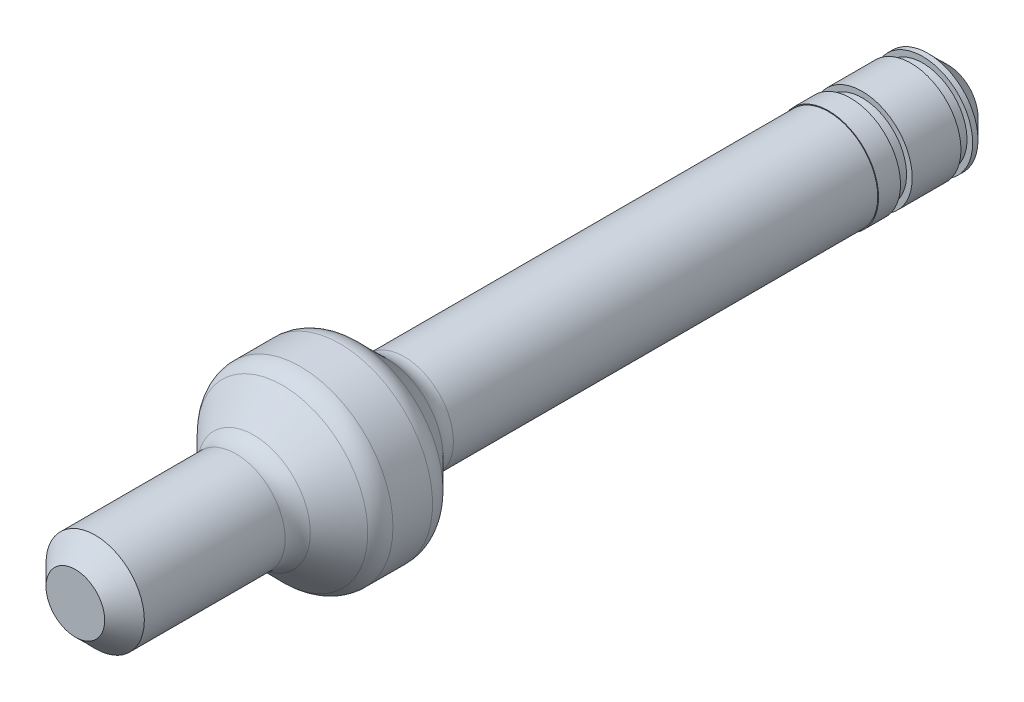
ISO-10303-21;
HEADER;
FILE_DESCRIPTION(('STEP AP214'),'2;1');
FILE_NAME('part.step','',(''),(''),'','','');
FILE_SCHEMA(('AUTOMOTIVE_DESIGN { 1 0 10303 214 1 1 1 1 }'));
ENDSEC;
DATA;
#1=APPLICATION_CONTEXT('core data for automotive mechanical design processes');
#2=APPLICATION_PROTOCOL_DEFINITION('international standard','automotive_design',2000,#1);
#3=PRODUCT_CONTEXT('',#1,'mechanical');
#4=PRODUCT('Part','Part','',(#3));
#5=PRODUCT_RELATED_PRODUCT_CATEGORY('part','',(#4));
#6=PRODUCT_DEFINITION_FORMATION('','',#4);
#7=PRODUCT_DEFINITION_CONTEXT('part definition',#1,'design');
#8=PRODUCT_DEFINITION('design','',#6,#7);
#9=PRODUCT_DEFINITION_SHAPE('','',#8);
#10=(LENGTH_UNIT() NAMED_UNIT(*) SI_UNIT(.MILLI.,.METRE.));
#11=(NAMED_UNIT(*) PLANE_ANGLE_UNIT() SI_UNIT($,.RADIAN.));
#12=(NAMED_UNIT(*) SI_UNIT($,.STERADIAN.) SOLID_ANGLE_UNIT());
#13=UNCERTAINTY_MEASURE_WITH_UNIT(LENGTH_MEASURE(1.E-05),#10,'distance_accuracy_value','');
#14=(GEOMETRIC_REPRESENTATION_CONTEXT(3) GLOBAL_UNCERTAINTY_ASSIGNED_CONTEXT((#13)) GLOBAL_UNIT_ASSIGNED_CONTEXT((#10,
#11,#12)) REPRESENTATION_CONTEXT('',''));
#15=CARTESIAN_POINT('',(0.,0.,0.));
#16=DIRECTION('',(0.,0.,1.));
#17=DIRECTION('',(1.,0.,0.));
#18=AXIS2_PLACEMENT_3D('',#15,#16,#17);
#19=CARTESIAN_POINT('',(0.,3.1496,-39.572));
#20=DIRECTION('',(0.,0.,1.));
#21=DIRECTION('',(1.,0.,0.));
#22=AXIS2_PLACEMENT_3D('',#19,#20,#21);
#23=PLANE('',#22);
#24=CARTESIAN_POINT('',(0.,0.,-39.572000000021));
#25=DIRECTION('',(0.,0.,1.));
#26=DIRECTION('',(1.,0.,0.));
#27=AXIS2_PLACEMENT_3D('',#24,#25,#26);
#28=CIRCLE('',#27,1.89960000000156);
#29=CARTESIAN_POINT('',(1.89960000000156,0.,-39.572000000021));
#30=VERTEX_POINT('',#29);
#31=EDGE_CURVE('E19',#30,#30,#28,.T.);
#32=ORIENTED_EDGE('',*,*,#31,.F.);
#33=EDGE_LOOP('',(#32));
#34=FACE_BOUND('',#33,.T.);
#35=ADVANCED_FACE('F16',(#34),#23,.F.);
#36=CARTESIAN_POINT('',(0.,0.,-38.3219999999937));
#37=DIRECTION('',(0.,0.,1.));
#38=DIRECTION('',(1.,0.,0.));
#39=AXIS2_PLACEMENT_3D('',#36,#37,#38);
#40=CONICAL_SURFACE('',#39,3.149599999972,0.785398163374711);
#41=ORIENTED_EDGE('',*,*,#31,.T.);
#42=EDGE_LOOP('',(#41));
#43=FACE_BOUND('',#42,.T.);
#44=CARTESIAN_POINT('',(0.,0.,-38.322));
#45=DIRECTION('',(0.,0.,1.));
#46=DIRECTION('',(1.,0.,0.));
#47=AXIS2_PLACEMENT_3D('',#44,#45,#46);
#48=CIRCLE('',#47,3.1496);
#49=CARTESIAN_POINT('',(3.1496,0.,-38.322));
#50=VERTEX_POINT('',#49);
#51=EDGE_CURVE('E185',#50,#50,#48,.T.);
#52=ORIENTED_EDGE('',*,*,#51,.F.);
#53=EDGE_LOOP('',(#52));
#54=FACE_BOUND('',#53,.T.);
#55=ADVANCED_FACE('F120',(#43,#54),#40,.T.);
#56=CARTESIAN_POINT('',(0.,0.,26.453846));
#57=DIRECTION('',(0.,0.,1.));
#58=DIRECTION('',(1.,0.,0.));
#59=AXIS2_PLACEMENT_3D('',#56,#57,#58);
#60=CYLINDRICAL_SURFACE('',#59,3.1496);
#61=ORIENTED_EDGE('',*,*,#51,.T.);
#62=EDGE_LOOP('',(#61));
#63=FACE_BOUND('',#62,.T.);
#64=CARTESIAN_POINT('',(0.,0.,-37.9845));
#65=DIRECTION('',(0.,0.,1.));
#66=DIRECTION('',(1.,0.,0.));
#67=AXIS2_PLACEMENT_3D('',#64,#65,#66);
#68=CIRCLE('',#67,3.1496);
#69=CARTESIAN_POINT('',(3.1496,0.,-37.9845));
#70=VERTEX_POINT('',#69);
#71=EDGE_CURVE('E183',#70,#70,#68,.F.);
#72=ORIENTED_EDGE('',*,*,#71,.T.);
#73=EDGE_LOOP('',(#72));
#74=FACE_BOUND('',#73,.T.);
#75=ADVANCED_FACE('F117',(#63,#74),#60,.T.);
#76=CARTESIAN_POINT('',(0.,3.1,15.428));
#77=DIRECTION('',(0.,0.,-1.));
#78=DIRECTION('',(-1.,0.,0.));
#79=AXIS2_PLACEMENT_3D('',#76,#77,#78);
#80=PLANE('',#79);
#81=CARTESIAN_POINT('',(0.,0.,15.4279999999289));
#82=DIRECTION('',(0.,0.,-1.));
#83=DIRECTION('',(-1.,0.,0.));
#84=AXIS2_PLACEMENT_3D('',#81,#82,#83);
#85=CIRCLE('',#84,1.84999999999036);
#86=CARTESIAN_POINT('',(-1.84999999999036,0.,15.4279999999289));
#87=VERTEX_POINT('',#86);
#88=EDGE_CURVE('E181',#87,#87,#85,.T.);
#89=ORIENTED_EDGE('',*,*,#88,.F.);
#90=EDGE_LOOP('',(#89));
#91=FACE_BOUND('',#90,.T.);
#92=ADVANCED_FACE('F113',(#91),#80,.F.);
#93=CARTESIAN_POINT('',(0.,2.794,-37.9845));
#94=DIRECTION('',(0.,0.,-1.));
#95=DIRECTION('',(-1.,0.,0.));
#96=AXIS2_PLACEMENT_3D('',#93,#94,#95);
#97=PLANE('',#96);
#98=CARTESIAN_POINT('',(0.,0.,-37.9845));
#99=DIRECTION('',(0.,0.,-1.));
#100=DIRECTION('',(-1.,0.,0.));
#101=AXIS2_PLACEMENT_3D('',#98,#99,#100);
#102=CIRCLE('',#101,2.794);
#103=CARTESIAN_POINT('',(-2.794,0.,-37.9845));
#104=VERTEX_POINT('',#103);
#105=EDGE_CURVE('E178',#104,#104,#102,.F.);
#106=ORIENTED_EDGE('',*,*,#105,.F.);
#107=EDGE_LOOP('',(#106));
#108=FACE_BOUND('',#107,.T.);
#109=ORIENTED_EDGE('',*,*,#71,.F.);
#110=EDGE_LOOP('',(#109));
#111=FACE_BOUND('',#110,.T.);
#112=ADVANCED_FACE('F109',(#108,#111),#97,.F.);
#113=CARTESIAN_POINT('',(0.,0.,14.1780000000722));
#114=DIRECTION('',(0.,0.,-1.));
#115=DIRECTION('',(-1.,0.,0.));
#116=AXIS2_PLACEMENT_3D('',#113,#114,#115);
#117=CONICAL_SURFACE('',#116,3.09999999990396,0.785398163420186);
#118=ORIENTED_EDGE('',*,*,#88,.T.);
#119=EDGE_LOOP('',(#118));
#120=FACE_BOUND('',#119,.T.);
#121=CARTESIAN_POINT('',(0.,0.,14.178));
#122=DIRECTION('',(0.,0.,1.));
#123=DIRECTION('',(1.,0.,0.));
#124=AXIS2_PLACEMENT_3D('',#121,#122,#123);
#125=CIRCLE('',#124,3.1);
#126=CARTESIAN_POINT('',(3.1,0.,14.178));
#127=VERTEX_POINT('',#126);
#128=EDGE_CURVE('E177',#127,#127,#125,.F.);
#129=ORIENTED_EDGE('',*,*,#128,.F.);
#130=EDGE_LOOP('',(#129));
#131=FACE_BOUND('',#130,.T.);
#132=ADVANCED_FACE('F105',(#120,#131),#117,.T.);
#133=CARTESIAN_POINT('',(0.,0.,-40.0654390361338));
#134=DIRECTION('',(0.,0.,-1.));
#135=DIRECTION('',(-1.,0.,0.));
#136=AXIS2_PLACEMENT_3D('',#133,#134,#135);
#137=CYLINDRICAL_SURFACE('',#136,2.794);
#138=ORIENTED_EDGE('',*,*,#105,.T.);
#139=EDGE_LOOP('',(#138));
#140=FACE_BOUND('',#139,.T.);
#141=CARTESIAN_POINT('',(0.,0.,-37.2479));
#142=DIRECTION('',(0.,0.,-1.));
#143=DIRECTION('',(-1.,0.,0.));
#144=AXIS2_PLACEMENT_3D('',#141,#142,#143);
#145=CIRCLE('',#144,2.794);
#146=CARTESIAN_POINT('',(-2.794,0.,-37.2479));
#147=VERTEX_POINT('',#146);
#148=EDGE_CURVE('E174',#147,#147,#145,.T.);
#149=ORIENTED_EDGE('',*,*,#148,.T.);
#150=EDGE_LOOP('',(#149));
#151=FACE_BOUND('',#150,.T.);
#152=ADVANCED_FACE('F101',(#140,#151),#137,.T.);
#153=CARTESIAN_POINT('',(0.,0.,26.453846));
#154=DIRECTION('',(0.,0.,1.));
#155=DIRECTION('',(1.,0.,0.));
#156=AXIS2_PLACEMENT_3D('',#153,#154,#155);
#157=CYLINDRICAL_SURFACE('',#156,3.1);
#158=CARTESIAN_POINT('',(0.,0.,5.30456403026728));
#159=DIRECTION('',(0.,0.,1.));
#160=DIRECTION('',(1.,0.,0.));
#161=AXIS2_PLACEMENT_3D('',#158,#159,#160);
#162=CIRCLE('',#161,3.1);
#163=CARTESIAN_POINT('',(3.1,0.,5.30456403026728));
#164=VERTEX_POINT('',#163);
#165=EDGE_CURVE('E85',#164,#164,#162,.T.);
#166=ORIENTED_EDGE('',*,*,#165,.T.);
#167=EDGE_LOOP('',(#166));
#168=FACE_BOUND('',#167,.T.);
#169=ORIENTED_EDGE('',*,*,#128,.T.);
#170=EDGE_LOOP('',(#169));
#171=FACE_BOUND('',#170,.T.);
#172=ADVANCED_FACE('F97',(#168,#171),#157,.T.);
#173=CARTESIAN_POINT('',(0.,2.794,-37.2479));
#174=DIRECTION('',(0.,0.,1.));
#175=DIRECTION('',(1.,0.,0.));
#176=AXIS2_PLACEMENT_3D('',#173,#174,#175);
#177=PLANE('',#176);
#178=CARTESIAN_POINT('',(0.,0.,-37.2479));
#179=DIRECTION('',(0.,0.,1.));
#180=DIRECTION('',(1.,0.,0.));
#181=AXIS2_PLACEMENT_3D('',#178,#179,#180);
#182=CIRCLE('',#181,3.1496);
#183=CARTESIAN_POINT('',(3.1496,0.,-37.2479));
#184=VERTEX_POINT('',#183);
#185=EDGE_CURVE('E82',#184,#184,#182,.T.);
#186=ORIENTED_EDGE('',*,*,#185,.F.);
#187=EDGE_LOOP('',(#186));
#188=FACE_BOUND('',#187,.T.);
#189=ORIENTED_EDGE('',*,*,#148,.F.);
#190=EDGE_LOOP('',(#189));
#191=FACE_BOUND('',#190,.T.);
#192=ADVANCED_FACE('F93',(#188,#191),#177,.F.);
#193=CARTESIAN_POINT('',(0.,0.,5.30456403026728));
#194=DIRECTION('',(0.,0.,1.));
#195=DIRECTION('',(1.,0.,0.));
#196=AXIS2_PLACEMENT_3D('',#193,#194,#195);
#197=TOROIDAL_SURFACE('',#196,4.6875,1.5875);
#198=CARTESIAN_POINT('',(0.,0.,4.18203201513734));
#199=DIRECTION('',(0.,0.,-1.));
#200=DIRECTION('',(-1.,0.,0.));
#201=AXIS2_PLACEMENT_3D('',#198,#199,#200);
#202=CIRCLE('',#201,3.5649679848575);
#203=CARTESIAN_POINT('',(-3.5649679848575,0.,4.18203201513734));
#204=VERTEX_POINT('',#203);
#205=EDGE_CURVE('E79',#204,#204,#202,.T.);
#206=ORIENTED_EDGE('',*,*,#205,.F.);
#207=EDGE_LOOP('',(#206));
#208=FACE_BOUND('',#207,.T.);
#209=ORIENTED_EDGE('',*,*,#165,.F.);
#210=EDGE_LOOP('',(#209));
#211=FACE_BOUND('',#210,.T.);
#212=ADVANCED_FACE('F88',(#208,#211),#197,.F.);
#213=CARTESIAN_POINT('',(0.,0.,26.453846));
#214=DIRECTION('',(0.,0.,1.));
#215=DIRECTION('',(1.,0.,0.));
#216=AXIS2_PLACEMENT_3D('',#213,#214,#215);
#217=CYLINDRICAL_SURFACE('',#216,3.1496);
#218=ORIENTED_EDGE('',*,*,#185,.T.);
#219=EDGE_LOOP('',(#218));
#220=FACE_BOUND('',#219,.T.);
#221=CARTESIAN_POINT('',(0.,0.,-34.1745));
#222=DIRECTION('',(0.,0.,1.));
#223=DIRECTION('',(1.,0.,0.));
#224=AXIS2_PLACEMENT_3D('',#221,#222,#223);
#225=CIRCLE('',#224,3.1496);
#226=CARTESIAN_POINT('',(3.1496,0.,-34.1745));
#227=VERTEX_POINT('',#226);
#228=EDGE_CURVE('E78',#227,#227,#225,.F.);
#229=ORIENTED_EDGE('',*,*,#228,.T.);
#230=EDGE_LOOP('',(#229));
#231=FACE_BOUND('',#230,.T.);
#232=ADVANCED_FACE('F92',(#220,#231),#217,.T.);
#233=CARTESIAN_POINT('',(0.,0.,2.36996798503242));
#234=DIRECTION('',(0.,0.,-1.));
#235=DIRECTION('',(-1.,0.,0.));
#236=AXIS2_PLACEMENT_3D('',#233,#234,#235);
#237=CONICAL_SURFACE('',#236,5.37703201501927,0.785398163413133);
#238=ORIENTED_EDGE('',*,*,#205,.T.);
#239=EDGE_LOOP('',(#238));
#240=FACE_BOUND('',#239,.T.);
#241=CARTESIAN_POINT('',(0.,0.,2.36996798486636));
#242=DIRECTION('',(0.,0.,-1.));
#243=DIRECTION('',(-1.,0.,0.));
#244=AXIS2_PLACEMENT_3D('',#241,#242,#243);
#245=CIRCLE('',#244,5.37703201513364);
#246=CARTESIAN_POINT('',(-5.37703201513364,0.,2.36996798486636));
#247=VERTEX_POINT('',#246);
#248=EDGE_CURVE('E75',#247,#247,#245,.T.);
#249=ORIENTED_EDGE('',*,*,#248,.F.);
#250=EDGE_LOOP('',(#249));
#251=FACE_BOUND('',#250,.T.);
#252=ADVANCED_FACE('F209',(#240,#251),#237,.T.);
#253=CARTESIAN_POINT('',(0.,3.1496,-34.1745));
#254=DIRECTION('',(0.,0.,-1.));
#255=DIRECTION('',(-1.,0.,0.));
#256=AXIS2_PLACEMENT_3D('',#253,#254,#255);
#257=PLANE('',#256);
#258=CARTESIAN_POINT('',(0.,0.,-34.1745));
#259=DIRECTION('',(0.,0.,-1.));
#260=DIRECTION('',(-1.,0.,0.));
#261=AXIS2_PLACEMENT_3D('',#258,#259,#260);
#262=CIRCLE('',#261,2.794);
#263=CARTESIAN_POINT('',(-2.794,0.,-34.1745));
#264=VERTEX_POINT('',#263);
#265=EDGE_CURVE('E74',#264,#264,#262,.F.);
#266=ORIENTED_EDGE('',*,*,#265,.F.);
#267=EDGE_LOOP('',(#266));
#268=FACE_BOUND('',#267,.T.);
#269=ORIENTED_EDGE('',*,*,#228,.F.);
#270=EDGE_LOOP('',(#269));
#271=FACE_BOUND('',#270,.T.);
#272=ADVANCED_FACE('F64',(#268,#271),#257,.F.);
#273=CARTESIAN_POINT('',(0.,0.,1.24743596973271));
#274=DIRECTION('',(0.,0.,-1.));
#275=DIRECTION('',(-1.,0.,0.));
#276=AXIS2_PLACEMENT_3D('',#273,#274,#275);
#277=TOROIDAL_SURFACE('',#276,4.2545,1.5875);
#278=ORIENTED_EDGE('',*,*,#248,.T.);
#279=EDGE_LOOP('',(#278));
#280=FACE_BOUND('',#279,.T.);
#281=CARTESIAN_POINT('',(0.,0.,1.24743596973271));
#282=DIRECTION('',(0.,0.,1.));
#283=DIRECTION('',(1.,0.,0.));
#284=AXIS2_PLACEMENT_3D('',#281,#282,#283);
#285=CIRCLE('',#284,5.842);
#286=CARTESIAN_POINT('',(5.842,0.,1.24743596973271));
#287=VERTEX_POINT('',#286);
#288=EDGE_CURVE('E70',#287,#287,#285,.F.);
#289=ORIENTED_EDGE('',*,*,#288,.F.);
#290=EDGE_LOOP('',(#289));
#291=FACE_BOUND('',#290,.T.);
#292=ADVANCED_FACE('F59',(#280,#291),#277,.T.);
#293=CARTESIAN_POINT('',(0.,0.,-40.0654390361338));
#294=DIRECTION('',(0.,0.,-1.));
#295=DIRECTION('',(-1.,0.,0.));
#296=AXIS2_PLACEMENT_3D('',#293,#294,#295);
#297=CYLINDRICAL_SURFACE('',#296,2.794);
#298=ORIENTED_EDGE('',*,*,#265,.T.);
#299=EDGE_LOOP('',(#298));
#300=FACE_BOUND('',#299,.T.);
#301=CARTESIAN_POINT('',(0.,0.,-33.4379));
#302=DIRECTION('',(0.,0.,-1.));
#303=DIRECTION('',(-1.,0.,0.));
#304=AXIS2_PLACEMENT_3D('',#301,#302,#303);
#305=CIRCLE('',#304,2.794);
#306=CARTESIAN_POINT('',(-2.794,0.,-33.4379));
#307=VERTEX_POINT('',#306);
#308=EDGE_CURVE('E73',#307,#307,#305,.T.);
#309=ORIENTED_EDGE('',*,*,#308,.T.);
#310=EDGE_LOOP('',(#309));
#311=FACE_BOUND('',#310,.T.);
#312=ADVANCED_FACE('F55',(#300,#311),#297,.T.);
#313=CARTESIAN_POINT('',(0.,0.,26.453846));
#314=DIRECTION('',(0.,0.,1.));
#315=DIRECTION('',(1.,0.,0.));
#316=AXIS2_PLACEMENT_3D('',#313,#314,#315);
#317=CYLINDRICAL_SURFACE('',#316,5.842);
#318=CARTESIAN_POINT('',(0.,0.,-1.24743596973272));
#319=DIRECTION('',(0.,0.,-1.));
#320=DIRECTION('',(-1.,0.,0.));
#321=AXIS2_PLACEMENT_3D('',#318,#319,#320);
#322=CIRCLE('',#321,5.842);
#323=CARTESIAN_POINT('',(-5.842,0.,-1.24743596973272));
#324=VERTEX_POINT('',#323);
#325=EDGE_CURVE('E69',#324,#324,#322,.T.);
#326=ORIENTED_EDGE('',*,*,#325,.F.);
#327=EDGE_LOOP('',(#326));
#328=FACE_BOUND('',#327,.T.);
#329=ORIENTED_EDGE('',*,*,#288,.T.);
#330=EDGE_LOOP('',(#329));
#331=FACE_BOUND('',#330,.T.);
#332=ADVANCED_FACE('F51',(#328,#331),#317,.T.);
#333=CARTESIAN_POINT('',(0.,3.1496,-33.4379));
#334=DIRECTION('',(0.,0.,1.));
#335=DIRECTION('',(1.,0.,0.));
#336=AXIS2_PLACEMENT_3D('',#333,#334,#335);
#337=PLANE('',#336);
#338=CARTESIAN_POINT('',(0.,0.,-33.4379));
#339=DIRECTION('',(0.,0.,1.));
#340=DIRECTION('',(1.,0.,0.));
#341=AXIS2_PLACEMENT_3D('',#338,#339,#340);
#342=CIRCLE('',#341,3.1496);
#343=CARTESIAN_POINT('',(3.1496,0.,-33.4379));
#344=VERTEX_POINT('',#343);
#345=EDGE_CURVE('E157',#344,#344,#342,.T.);
#346=ORIENTED_EDGE('',*,*,#345,.F.);
#347=EDGE_LOOP('',(#346));
#348=FACE_BOUND('',#347,.T.);
#349=ORIENTED_EDGE('',*,*,#308,.F.);
#350=EDGE_LOOP('',(#349));
#351=FACE_BOUND('',#350,.T.);
#352=ADVANCED_FACE('F46',(#348,#351),#337,.F.);
#353=CARTESIAN_POINT('',(0.,0.,-1.24743596973272));
#354=DIRECTION('',(0.,0.,-1.));
#355=DIRECTION('',(-1.,0.,0.));
#356=AXIS2_PLACEMENT_3D('',#353,#354,#355);
#357=TOROIDAL_SURFACE('',#356,4.2545,1.5875);
#358=ORIENTED_EDGE('',*,*,#325,.T.);
#359=EDGE_LOOP('',(#358));
#360=FACE_BOUND('',#359,.T.);
#361=CARTESIAN_POINT('',(0.,0.,-2.36996798486189));
#362=DIRECTION('',(0.,0.,1.));
#363=DIRECTION('',(1.,0.,0.));
#364=AXIS2_PLACEMENT_3D('',#361,#362,#363);
#365=CIRCLE('',#364,5.37703201513295);
#366=CARTESIAN_POINT('',(5.37703201513295,0.,-2.36996798486189));
#367=VERTEX_POINT('',#366);
#368=EDGE_CURVE('E38',#367,#367,#365,.F.);
#369=ORIENTED_EDGE('',*,*,#368,.F.);
#370=EDGE_LOOP('',(#369));
#371=FACE_BOUND('',#370,.T.);
#372=ADVANCED_FACE('F41',(#360,#371),#357,.T.);
#373=CARTESIAN_POINT('',(0.,0.,26.453846));
#374=DIRECTION('',(0.,0.,1.));
#375=DIRECTION('',(1.,0.,0.));
#376=AXIS2_PLACEMENT_3D('',#373,#374,#375);
#377=CYLINDRICAL_SURFACE('',#376,3.1496);
#378=CARTESIAN_POINT('',(0.,0.,-32.0536));
#379=DIRECTION('',(0.,0.,1.));
#380=DIRECTION('',(1.,0.,0.));
#381=AXIS2_PLACEMENT_3D('',#378,#379,#380);
#382=CIRCLE('',#381,3.1496);
#383=CARTESIAN_POINT('',(3.1496,0.,-32.0536));
#384=VERTEX_POINT('',#383);
#385=EDGE_CURVE('E35',#384,#384,#382,.F.);
#386=ORIENTED_EDGE('',*,*,#385,.T.);
#387=EDGE_LOOP('',(#386));
#388=FACE_BOUND('',#387,.T.);
#389=ORIENTED_EDGE('',*,*,#345,.T.);
#390=EDGE_LOOP('',(#389));
#391=FACE_BOUND('',#390,.T.);
#392=ADVANCED_FACE('F45',(#388,#391),#377,.T.);
#393=CARTESIAN_POINT('',(0.,0.,-2.36996798491873));
#394=DIRECTION('',(0.,0.,1.));
#395=DIRECTION('',(1.,0.,0.));
#396=AXIS2_PLACEMENT_3D('',#393,#394,#395);
#397=CONICAL_SURFACE('',#396,5.37703201507611,0.785398163397448);
#398=CARTESIAN_POINT('',(0.,0.,-4.18203201513368));
#399=DIRECTION('',(0.,0.,1.));
#400=DIRECTION('',(1.,0.,0.));
#401=AXIS2_PLACEMENT_3D('',#398,#399,#400);
#402=CIRCLE('',#401,3.56496798486635);
#403=CARTESIAN_POINT('',(3.56496798486635,0.,-4.18203201513368));
#404=VERTEX_POINT('',#403);
#405=EDGE_CURVE('E28',#404,#404,#402,.T.);
#406=ORIENTED_EDGE('',*,*,#405,.T.);
#407=EDGE_LOOP('',(#406));
#408=FACE_BOUND('',#407,.T.);
#409=ORIENTED_EDGE('',*,*,#368,.T.);
#410=EDGE_LOOP('',(#409));
#411=FACE_BOUND('',#410,.T.);
#412=ADVANCED_FACE('F144',(#408,#411),#397,.T.);
#413=CARTESIAN_POINT('',(0.,3.1496,-32.0536));
#414=DIRECTION('',(0.,0.,-1.));
#415=DIRECTION('',(-1.,0.,0.));
#416=AXIS2_PLACEMENT_3D('',#413,#414,#415);
#417=PLANE('',#416);
#418=ORIENTED_EDGE('',*,*,#385,.F.);
#419=EDGE_LOOP('',(#418));
#420=FACE_BOUND('',#419,.T.);
#421=CARTESIAN_POINT('',(0.,0.,-32.0536));
#422=DIRECTION('',(0.,0.,1.));
#423=DIRECTION('',(1.,0.,0.));
#424=AXIS2_PLACEMENT_3D('',#421,#422,#423);
#425=CIRCLE('',#424,3.1);
#426=CARTESIAN_POINT('',(3.1,0.,-32.0536));
#427=VERTEX_POINT('',#426);
#428=EDGE_CURVE('E23',#427,#427,#425,.T.);
#429=ORIENTED_EDGE('',*,*,#428,.F.);
#430=EDGE_LOOP('',(#429));
#431=FACE_BOUND('',#430,.T.);
#432=ADVANCED_FACE('F139',(#420,#431),#417,.F.);
#433=CARTESIAN_POINT('',(0.,0.,-5.30456403026731));
#434=DIRECTION('',(0.,0.,1.));
#435=DIRECTION('',(1.,0.,0.));
#436=AXIS2_PLACEMENT_3D('',#433,#434,#435);
#437=TOROIDAL_SURFACE('',#436,4.6875,1.5875);
#438=CARTESIAN_POINT('',(0.,0.,-5.30456403026731));
#439=DIRECTION('',(0.,0.,1.));
#440=DIRECTION('',(1.,0.,0.));
#441=AXIS2_PLACEMENT_3D('',#438,#439,#440);
#442=CIRCLE('',#441,3.1);
#443=CARTESIAN_POINT('',(3.1,0.,-5.30456403026731));
#444=VERTEX_POINT('',#443);
#445=EDGE_CURVE('E10',#444,#444,#442,.F.);
#446=ORIENTED_EDGE('',*,*,#445,.F.);
#447=EDGE_LOOP('',(#446));
#448=FACE_BOUND('',#447,.T.);
#449=ORIENTED_EDGE('',*,*,#405,.F.);
#450=EDGE_LOOP('',(#449));
#451=FACE_BOUND('',#450,.T.);
#452=ADVANCED_FACE('F133',(#448,#451),#437,.F.);
#453=CARTESIAN_POINT('',(0.,0.,26.453846));
#454=DIRECTION('',(0.,0.,1.));
#455=DIRECTION('',(1.,0.,0.));
#456=AXIS2_PLACEMENT_3D('',#453,#454,#455);
#457=CYLINDRICAL_SURFACE('',#456,3.1);
#458=ORIENTED_EDGE('',*,*,#428,.T.);
#459=EDGE_LOOP('',(#458));
#460=FACE_BOUND('',#459,.T.);
#461=ORIENTED_EDGE('',*,*,#445,.T.);
#462=EDGE_LOOP('',(#461));
#463=FACE_BOUND('',#462,.T.);
#464=ADVANCED_FACE('F131',(#460,#463),#457,.T.);
#465=CLOSED_SHELL('',(#35,#55,#75,#92,#112,#132,#152,#172,#192,#212,#232,#252,#272,#292,#312,
#332,#352,#372,#392,#412,#432,#452,#464));
#466=MANIFOLD_SOLID_BREP('B1',#465);
#467=ADVANCED_BREP_SHAPE_REPRESENTATION('',(#18,#466),#14);
#468=SHAPE_DEFINITION_REPRESENTATION(#9,#467);
ENDSEC;
END-ISO-10303-21;
